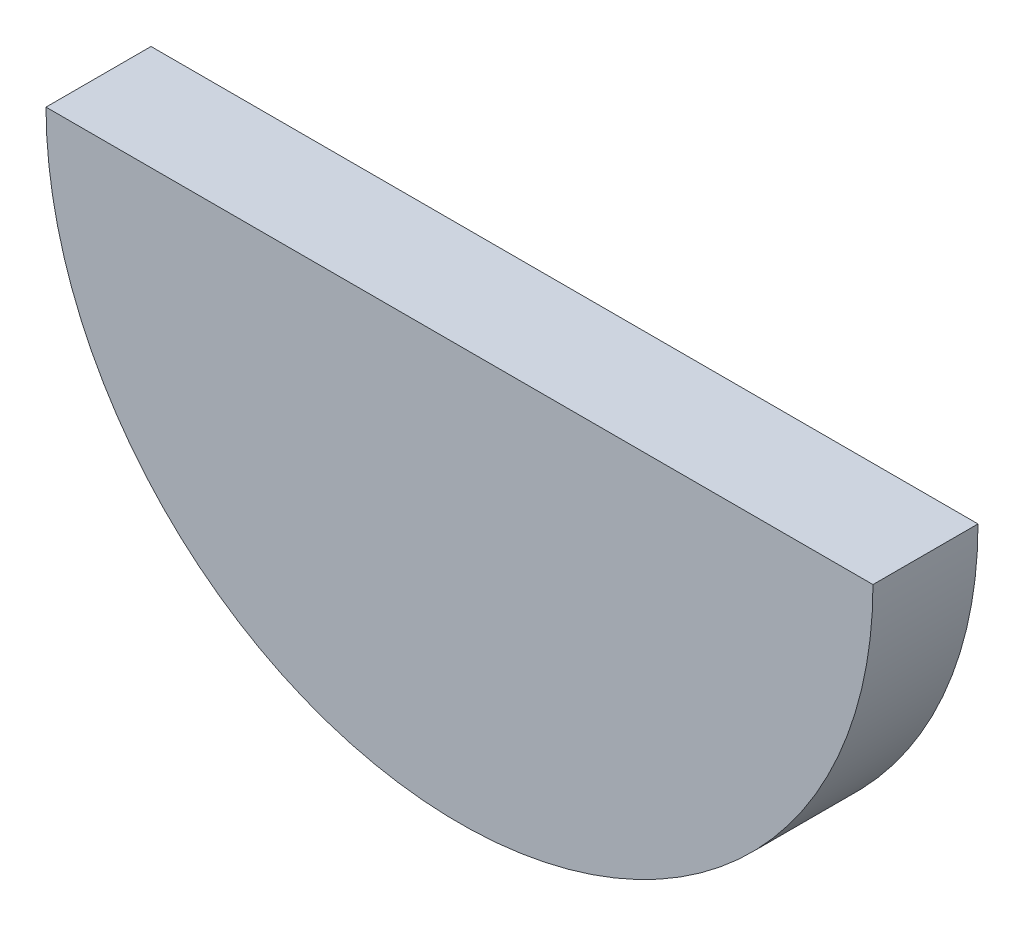
ISO-10303-21;
HEADER;
FILE_DESCRIPTION(('STEP AP214'),'2;1');
FILE_NAME('part.step','',(''),(''),'','','');
FILE_SCHEMA(('AUTOMOTIVE_DESIGN { 1 0 10303 214 1 1 1 1 }'));
ENDSEC;
DATA;
#1=APPLICATION_CONTEXT('core data for automotive mechanical design processes');
#2=APPLICATION_PROTOCOL_DEFINITION('international standard','automotive_design',2000,#1);
#3=PRODUCT_CONTEXT('',#1,'mechanical');
#4=PRODUCT('Part','Part','',(#3));
#5=PRODUCT_RELATED_PRODUCT_CATEGORY('part','',(#4));
#6=PRODUCT_DEFINITION_FORMATION('','',#4);
#7=PRODUCT_DEFINITION_CONTEXT('part definition',#1,'design');
#8=PRODUCT_DEFINITION('design','',#6,#7);
#9=PRODUCT_DEFINITION_SHAPE('','',#8);
#10=(LENGTH_UNIT() NAMED_UNIT(*) SI_UNIT(.MILLI.,.METRE.));
#11=(NAMED_UNIT(*) PLANE_ANGLE_UNIT() SI_UNIT($,.RADIAN.));
#12=(NAMED_UNIT(*) SI_UNIT($,.STERADIAN.) SOLID_ANGLE_UNIT());
#13=UNCERTAINTY_MEASURE_WITH_UNIT(LENGTH_MEASURE(1.E-05),#10,'distance_accuracy_value','');
#14=(GEOMETRIC_REPRESENTATION_CONTEXT(3) GLOBAL_UNCERTAINTY_ASSIGNED_CONTEXT((#13)) GLOBAL_UNIT_ASSIGNED_CONTEXT((#10,
#11,#12)) REPRESENTATION_CONTEXT('',''));
#15=CARTESIAN_POINT('',(0.,0.,0.));
#16=DIRECTION('',(0.,0.,1.));
#17=DIRECTION('',(1.,0.,0.));
#18=AXIS2_PLACEMENT_3D('',#15,#16,#17);
#19=CARTESIAN_POINT('',(0.,0.,101.6));
#20=DIRECTION('',(0.,0.,-1.));
#21=DIRECTION('',(-1.,0.,0.));
#22=AXIS2_PLACEMENT_3D('',#19,#20,#21);
#23=CYLINDRICAL_SURFACE('',#22,400.);
#24=CARTESIAN_POINT('',(0.,0.,0.));
#25=DIRECTION('',(0.,0.,1.));
#26=DIRECTION('',(1.,0.,0.));
#27=AXIS2_PLACEMENT_3D('',#24,#25,#26);
#28=CIRCLE('',#27,400.);
#29=CARTESIAN_POINT('',(-400.,0.,0.));
#30=VERTEX_POINT('',#29);
#31=CARTESIAN_POINT('',(400.,0.,0.));
#32=VERTEX_POINT('',#31);
#33=EDGE_CURVE('E65',#30,#32,#28,.T.);
#34=ORIENTED_EDGE('',*,*,#33,.T.);
#35=DIRECTION('',(0.,0.,-1.));
#36=VECTOR('',#35,1.);
#37=CARTESIAN_POINT('',(400.,0.,101.6));
#38=LINE('',#37,#36);
#39=CARTESIAN_POINT('',(400.,0.,101.6));
#40=VERTEX_POINT('',#39);
#41=EDGE_CURVE('E11',#40,#32,#38,.T.);
#42=ORIENTED_EDGE('',*,*,#41,.F.);
#43=CARTESIAN_POINT('',(0.,0.,101.6));
#44=DIRECTION('',(0.,0.,1.));
#45=DIRECTION('',(1.,0.,0.));
#46=AXIS2_PLACEMENT_3D('',#43,#44,#45);
#47=CIRCLE('',#46,400.);
#48=CARTESIAN_POINT('',(-400.,0.,101.6));
#49=VERTEX_POINT('',#48);
#50=EDGE_CURVE('E64',#49,#40,#47,.T.);
#51=ORIENTED_EDGE('',*,*,#50,.F.);
#52=DIRECTION('',(0.,0.,-1.));
#53=VECTOR('',#52,1.);
#54=CARTESIAN_POINT('',(-400.,0.,101.6));
#55=LINE('',#54,#53);
#56=EDGE_CURVE('E42',#49,#30,#55,.T.);
#57=ORIENTED_EDGE('',*,*,#56,.T.);
#58=EDGE_LOOP('',(#34,#42,#51,#57));
#59=FACE_BOUND('',#58,.T.);
#60=ADVANCED_FACE('F34',(#59),#23,.T.);
#61=CARTESIAN_POINT('',(-400.,0.,101.6));
#62=DIRECTION('',(0.,-1.,0.));
#63=DIRECTION('',(0.,0.,-1.));
#64=AXIS2_PLACEMENT_3D('',#61,#62,#63);
#65=PLANE('',#64);
#66=DIRECTION('',(-1.,0.,0.));
#67=VECTOR('',#66,1.);
#68=CARTESIAN_POINT('',(-400.,0.,0.));
#69=LINE('',#68,#67);
#70=EDGE_CURVE('E57',#32,#30,#69,.T.);
#71=ORIENTED_EDGE('',*,*,#70,.T.);
#72=ORIENTED_EDGE('',*,*,#56,.F.);
#73=DIRECTION('',(-1.,0.,0.));
#74=VECTOR('',#73,1.);
#75=CARTESIAN_POINT('',(-400.,0.,101.6));
#76=LINE('',#75,#74);
#77=EDGE_CURVE('E49',#40,#49,#76,.T.);
#78=ORIENTED_EDGE('',*,*,#77,.F.);
#79=ORIENTED_EDGE('',*,*,#41,.T.);
#80=EDGE_LOOP('',(#71,#72,#78,#79));
#81=FACE_BOUND('',#80,.T.);
#82=ADVANCED_FACE('F60',(#81),#65,.F.);
#83=CARTESIAN_POINT('',(0.,0.,101.6));
#84=DIRECTION('',(0.,0.,1.));
#85=DIRECTION('',(1.,0.,0.));
#86=AXIS2_PLACEMENT_3D('',#83,#84,#85);
#87=PLANE('',#86);
#88=ORIENTED_EDGE('',*,*,#50,.T.);
#89=ORIENTED_EDGE('',*,*,#77,.T.);
#90=EDGE_LOOP('',(#88,#89));
#91=FACE_BOUND('',#90,.T.);
#92=ADVANCED_FACE('F72',(#91),#87,.T.);
#93=CARTESIAN_POINT('',(0.,0.,0.));
#94=DIRECTION('',(0.,0.,1.));
#95=DIRECTION('',(1.,0.,0.));
#96=AXIS2_PLACEMENT_3D('',#93,#94,#95);
#97=PLANE('',#96);
#98=ORIENTED_EDGE('',*,*,#33,.F.);
#99=ORIENTED_EDGE('',*,*,#70,.F.);
#100=EDGE_LOOP('',(#98,#99));
#101=FACE_BOUND('',#100,.T.);
#102=ADVANCED_FACE('F68',(#101),#97,.F.);
#103=CLOSED_SHELL('',(#60,#82,#92,#102));
#104=MANIFOLD_SOLID_BREP('B2',#103);
#105=ADVANCED_BREP_SHAPE_REPRESENTATION('',(#18,#104),#14);
#106=SHAPE_DEFINITION_REPRESENTATION(#9,#105);
ENDSEC;
END-ISO-10303-21;
